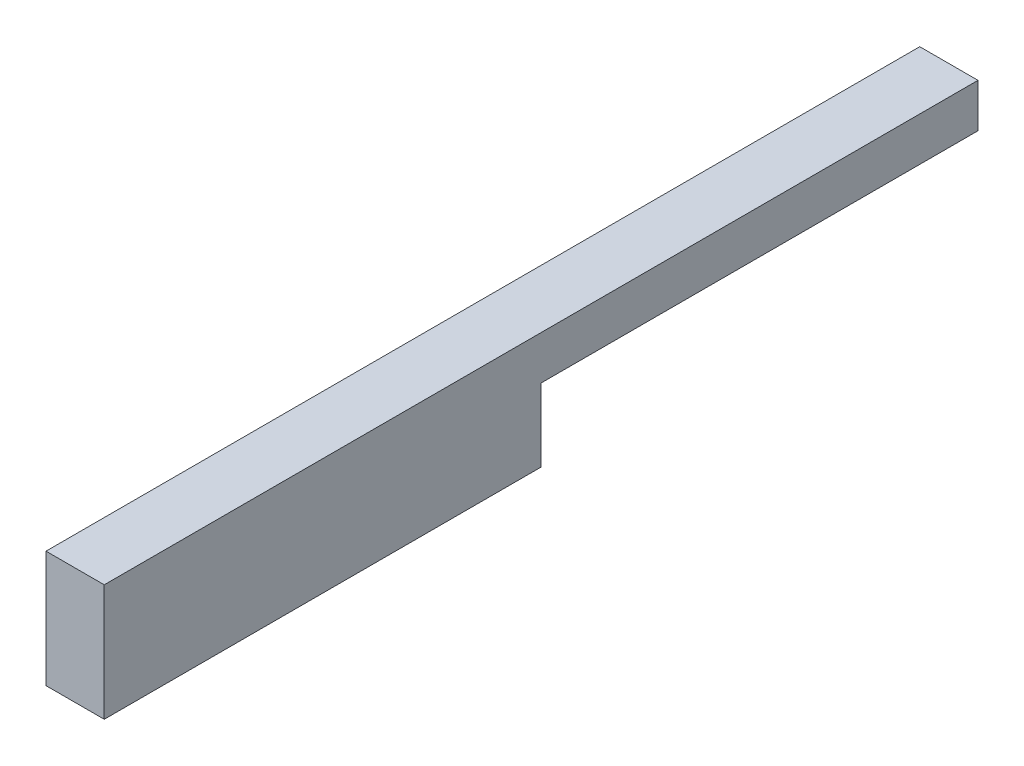
ISO-10303-21;
HEADER;
FILE_DESCRIPTION(('STEP AP214'),'2;1');
FILE_NAME('part.step','',(''),(''),'','','');
FILE_SCHEMA(('AUTOMOTIVE_DESIGN { 1 0 10303 214 1 1 1 1 }'));
ENDSEC;
DATA;
#1=APPLICATION_CONTEXT('core data for automotive mechanical design processes');
#2=APPLICATION_PROTOCOL_DEFINITION('international standard','automotive_design',2000,#1);
#3=PRODUCT_CONTEXT('',#1,'mechanical');
#4=PRODUCT('Part','Part','',(#3));
#5=PRODUCT_RELATED_PRODUCT_CATEGORY('part','',(#4));
#6=PRODUCT_DEFINITION_FORMATION('','',#4);
#7=PRODUCT_DEFINITION_CONTEXT('part definition',#1,'design');
#8=PRODUCT_DEFINITION('design','',#6,#7);
#9=PRODUCT_DEFINITION_SHAPE('','',#8);
#10=(LENGTH_UNIT() NAMED_UNIT(*) SI_UNIT(.MILLI.,.METRE.));
#11=(NAMED_UNIT(*) PLANE_ANGLE_UNIT() SI_UNIT($,.RADIAN.));
#12=(NAMED_UNIT(*) SI_UNIT($,.STERADIAN.) SOLID_ANGLE_UNIT());
#13=UNCERTAINTY_MEASURE_WITH_UNIT(LENGTH_MEASURE(1.E-05),#10,'distance_accuracy_value','');
#14=(GEOMETRIC_REPRESENTATION_CONTEXT(3) GLOBAL_UNCERTAINTY_ASSIGNED_CONTEXT((#13)) GLOBAL_UNIT_ASSIGNED_CONTEXT((#10,
#11,#12)) REPRESENTATION_CONTEXT('',''));
#15=CARTESIAN_POINT('',(0.,0.,0.));
#16=DIRECTION('',(0.,0.,1.));
#17=DIRECTION('',(1.,0.,0.));
#18=AXIS2_PLACEMENT_3D('',#15,#16,#17);
#19=CARTESIAN_POINT('',(4.,0.999349283355752,-40.013014332885));
#20=DIRECTION('',(0.,-1.,0.));
#21=DIRECTION('',(0.,0.,-1.));
#22=AXIS2_PLACEMENT_3D('',#19,#20,#21);
#23=PLANE('',#22);
#24=DIRECTION('',(0.,0.,1.));
#25=VECTOR('',#24,1.);
#26=CARTESIAN_POINT('',(0.,0.999349283355752,-40.013014332885));
#27=LINE('',#26,#25);
#28=CARTESIAN_POINT('',(0.,0.999349283355752,-40.013014332885));
#29=VERTEX_POINT('',#28);
#30=CARTESIAN_POINT('',(0.,0.999349283355745,19.986985667115));
#31=VERTEX_POINT('',#30);
#32=EDGE_CURVE('E128',#29,#31,#27,.T.);
#33=ORIENTED_EDGE('',*,*,#32,.T.);
#34=DIRECTION('',(-1.,0.,0.));
#35=VECTOR('',#34,1.);
#36=CARTESIAN_POINT('',(4.,0.999349283355745,19.986985667115));
#37=LINE('',#36,#35);
#38=CARTESIAN_POINT('',(4.,0.999349283355745,19.986985667115));
#39=VERTEX_POINT('',#38);
#40=EDGE_CURVE('E11',#39,#31,#37,.T.);
#41=ORIENTED_EDGE('',*,*,#40,.F.);
#42=DIRECTION('',(0.,0.,1.));
#43=VECTOR('',#42,1.);
#44=CARTESIAN_POINT('',(4.,0.999349283355752,-40.013014332885));
#45=LINE('',#44,#43);
#46=CARTESIAN_POINT('',(4.,0.999349283355752,-40.013014332885));
#47=VERTEX_POINT('',#46);
#48=EDGE_CURVE('E144',#47,#39,#45,.T.);
#49=ORIENTED_EDGE('',*,*,#48,.F.);
#50=DIRECTION('',(-1.,0.,0.));
#51=VECTOR('',#50,1.);
#52=CARTESIAN_POINT('',(4.,0.999349283355752,-40.013014332885));
#53=LINE('',#52,#51);
#54=EDGE_CURVE('E124',#47,#29,#53,.T.);
#55=ORIENTED_EDGE('',*,*,#54,.T.);
#56=EDGE_LOOP('',(#33,#41,#49,#55));
#57=FACE_BOUND('',#56,.T.);
#58=ADVANCED_FACE('F39',(#57),#23,.F.);
#59=CARTESIAN_POINT('',(4.,-0.383828286737714,19.986985667115));
#60=DIRECTION('',(0.,0.,-1.));
#61=DIRECTION('',(-1.,0.,0.));
#62=AXIS2_PLACEMENT_3D('',#59,#60,#61);
#63=PLANE('',#62);
#64=DIRECTION('',(0.,-1.,0.));
#65=VECTOR('',#64,1.);
#66=CARTESIAN_POINT('',(0.,-0.383828286737714,19.986985667115));
#67=LINE('',#66,#65);
#68=CARTESIAN_POINT('',(0.,-7.00065071664426,19.986985667115));
#69=VERTEX_POINT('',#68);
#70=EDGE_CURVE('E132',#31,#69,#67,.T.);
#71=ORIENTED_EDGE('',*,*,#70,.T.);
#72=DIRECTION('',(-1.,0.,0.));
#73=VECTOR('',#72,1.);
#74=CARTESIAN_POINT('',(4.,-7.00065071664426,19.986985667115));
#75=LINE('',#74,#73);
#76=CARTESIAN_POINT('',(4.,-7.00065071664426,19.986985667115));
#77=VERTEX_POINT('',#76);
#78=EDGE_CURVE('E48',#77,#69,#75,.T.);
#79=ORIENTED_EDGE('',*,*,#78,.F.);
#80=DIRECTION('',(0.,-1.,0.));
#81=VECTOR('',#80,1.);
#82=CARTESIAN_POINT('',(4.,0.999349283355745,19.986985667115));
#83=LINE('',#82,#81);
#84=EDGE_CURVE('E93',#39,#77,#83,.T.);
#85=ORIENTED_EDGE('',*,*,#84,.F.);
#86=ORIENTED_EDGE('',*,*,#40,.T.);
#87=EDGE_LOOP('',(#71,#79,#85,#86));
#88=FACE_BOUND('',#87,.T.);
#89=ADVANCED_FACE('F172',(#88),#63,.F.);
#90=CARTESIAN_POINT('',(4.,-7.00065071664426,19.986985667115));
#91=DIRECTION('',(0.,1.,0.));
#92=DIRECTION('',(0.,0.,1.));
#93=AXIS2_PLACEMENT_3D('',#90,#91,#92);
#94=PLANE('',#93);
#95=DIRECTION('',(0.,0.,-1.));
#96=VECTOR('',#95,1.);
#97=CARTESIAN_POINT('',(0.,-7.00065071664426,19.986985667115));
#98=LINE('',#97,#96);
#99=CARTESIAN_POINT('',(0.,-7.00065071664426,-10.013014332885));
#100=VERTEX_POINT('',#99);
#101=EDGE_CURVE('E135',#69,#100,#98,.T.);
#102=ORIENTED_EDGE('',*,*,#101,.T.);
#103=DIRECTION('',(-1.,0.,0.));
#104=VECTOR('',#103,1.);
#105=CARTESIAN_POINT('',(4.,-7.00065071664426,-10.013014332885));
#106=LINE('',#105,#104);
#107=CARTESIAN_POINT('',(4.,-7.00065071664426,-10.013014332885));
#108=VERTEX_POINT('',#107);
#109=EDGE_CURVE('E117',#108,#100,#106,.T.);
#110=ORIENTED_EDGE('',*,*,#109,.F.);
#111=DIRECTION('',(0.,0.,-1.));
#112=VECTOR('',#111,1.);
#113=CARTESIAN_POINT('',(4.,-7.00065071664426,19.986985667115));
#114=LINE('',#113,#112);
#115=EDGE_CURVE('E106',#77,#108,#114,.T.);
#116=ORIENTED_EDGE('',*,*,#115,.F.);
#117=ORIENTED_EDGE('',*,*,#78,.T.);
#118=EDGE_LOOP('',(#102,#110,#116,#117));
#119=FACE_BOUND('',#118,.T.);
#120=ADVANCED_FACE('F154',(#119),#94,.F.);
#121=CARTESIAN_POINT('',(4.,-7.00065071664426,-10.013014332885));
#122=DIRECTION('',(0.,0.,1.));
#123=DIRECTION('',(0.,-1.,0.));
#124=AXIS2_PLACEMENT_3D('',#121,#122,#123);
#125=PLANE('',#124);
#126=DIRECTION('',(0.,1.,0.));
#127=VECTOR('',#126,1.);
#128=CARTESIAN_POINT('',(0.,-7.00065071664426,-10.013014332885));
#129=LINE('',#128,#127);
#130=CARTESIAN_POINT('',(0.,-2.00065071664425,-10.013014332885));
#131=VERTEX_POINT('',#130);
#132=EDGE_CURVE('E115',#100,#131,#129,.T.);
#133=ORIENTED_EDGE('',*,*,#132,.T.);
#134=DIRECTION('',(-1.,0.,0.));
#135=VECTOR('',#134,1.);
#136=CARTESIAN_POINT('',(4.,-2.00065071664425,-10.013014332885));
#137=LINE('',#136,#135);
#138=CARTESIAN_POINT('',(4.,-2.00065071664425,-10.013014332885));
#139=VERTEX_POINT('',#138);
#140=EDGE_CURVE('E112',#139,#131,#137,.T.);
#141=ORIENTED_EDGE('',*,*,#140,.F.);
#142=DIRECTION('',(0.,1.,0.));
#143=VECTOR('',#142,1.);
#144=CARTESIAN_POINT('',(4.,-7.00065071664426,-10.013014332885));
#145=LINE('',#144,#143);
#146=EDGE_CURVE('E100',#108,#139,#145,.T.);
#147=ORIENTED_EDGE('',*,*,#146,.F.);
#148=ORIENTED_EDGE('',*,*,#109,.T.);
#149=EDGE_LOOP('',(#133,#141,#147,#148));
#150=FACE_BOUND('',#149,.T.);
#151=ADVANCED_FACE('F113',(#150),#125,.F.);
#152=CARTESIAN_POINT('',(4.,-2.00065071664425,-40.013014332885));
#153=DIRECTION('',(0.,1.,0.));
#154=DIRECTION('',(0.,0.,1.));
#155=AXIS2_PLACEMENT_3D('',#152,#153,#154);
#156=PLANE('',#155);
#157=DIRECTION('',(0.,0.,-1.));
#158=VECTOR('',#157,1.);
#159=CARTESIAN_POINT('',(0.,-2.00065071664425,-40.013014332885));
#160=LINE('',#159,#158);
#161=CARTESIAN_POINT('',(0.,-2.00065071664425,-40.013014332885));
#162=VERTEX_POINT('',#161);
#163=EDGE_CURVE('E79',#131,#162,#160,.T.);
#164=ORIENTED_EDGE('',*,*,#163,.T.);
#165=DIRECTION('',(-1.,0.,0.));
#166=VECTOR('',#165,1.);
#167=CARTESIAN_POINT('',(4.,-2.00065071664425,-40.013014332885));
#168=LINE('',#167,#166);
#169=CARTESIAN_POINT('',(4.,-2.00065071664425,-40.013014332885));
#170=VERTEX_POINT('',#169);
#171=EDGE_CURVE('E118',#170,#162,#168,.T.);
#172=ORIENTED_EDGE('',*,*,#171,.F.);
#173=DIRECTION('',(0.,0.,-1.));
#174=VECTOR('',#173,1.);
#175=CARTESIAN_POINT('',(4.,-2.00065071664425,-40.013014332885));
#176=LINE('',#175,#174);
#177=EDGE_CURVE('E104',#139,#170,#176,.T.);
#178=ORIENTED_EDGE('',*,*,#177,.F.);
#179=ORIENTED_EDGE('',*,*,#140,.T.);
#180=EDGE_LOOP('',(#164,#172,#178,#179));
#181=FACE_BOUND('',#180,.T.);
#182=ADVANCED_FACE('F120',(#181),#156,.F.);
#183=CARTESIAN_POINT('',(4.,-2.00065071664425,-40.013014332885));
#184=DIRECTION('',(0.,0.,1.));
#185=DIRECTION('',(1.,0.,0.));
#186=AXIS2_PLACEMENT_3D('',#183,#184,#185);
#187=PLANE('',#186);
#188=DIRECTION('',(0.,1.,0.));
#189=VECTOR('',#188,1.);
#190=CARTESIAN_POINT('',(0.,-2.00065071664425,-40.013014332885));
#191=LINE('',#190,#189);
#192=EDGE_CURVE('E85',#162,#29,#191,.T.);
#193=ORIENTED_EDGE('',*,*,#192,.T.);
#194=ORIENTED_EDGE('',*,*,#54,.F.);
#195=DIRECTION('',(0.,1.,0.));
#196=VECTOR('',#195,1.);
#197=CARTESIAN_POINT('',(4.,-2.00065071664425,-40.013014332885));
#198=LINE('',#197,#196);
#199=EDGE_CURVE('E56',#170,#47,#198,.T.);
#200=ORIENTED_EDGE('',*,*,#199,.F.);
#201=ORIENTED_EDGE('',*,*,#171,.T.);
#202=EDGE_LOOP('',(#193,#194,#200,#201));
#203=FACE_BOUND('',#202,.T.);
#204=ADVANCED_FACE('F161',(#203),#187,.F.);
#205=CARTESIAN_POINT('',(4.,0.,0.));
#206=DIRECTION('',(1.,0.,0.));
#207=DIRECTION('',(0.,0.,-1.));
#208=AXIS2_PLACEMENT_3D('',#205,#206,#207);
#209=PLANE('',#208);
#210=ORIENTED_EDGE('',*,*,#48,.T.);
#211=ORIENTED_EDGE('',*,*,#84,.T.);
#212=ORIENTED_EDGE('',*,*,#115,.T.);
#213=ORIENTED_EDGE('',*,*,#146,.T.);
#214=ORIENTED_EDGE('',*,*,#177,.T.);
#215=ORIENTED_EDGE('',*,*,#199,.T.);
#216=EDGE_LOOP('',(#210,#211,#212,#213,#214,#215));
#217=FACE_BOUND('',#216,.T.);
#218=ADVANCED_FACE('F102',(#217),#209,.T.);
#219=CARTESIAN_POINT('',(0.,0.,0.));
#220=DIRECTION('',(1.,0.,0.));
#221=DIRECTION('',(0.,0.,-1.));
#222=AXIS2_PLACEMENT_3D('',#219,#220,#221);
#223=PLANE('',#222);
#224=ORIENTED_EDGE('',*,*,#32,.F.);
#225=ORIENTED_EDGE('',*,*,#192,.F.);
#226=ORIENTED_EDGE('',*,*,#163,.F.);
#227=ORIENTED_EDGE('',*,*,#132,.F.);
#228=ORIENTED_EDGE('',*,*,#101,.F.);
#229=ORIENTED_EDGE('',*,*,#70,.F.);
#230=EDGE_LOOP('',(#224,#225,#226,#227,#228,#229));
#231=FACE_BOUND('',#230,.T.);
#232=ADVANCED_FACE('F157',(#231),#223,.F.);
#233=CLOSED_SHELL('',(#58,#89,#120,#151,#182,#204,#218,#232));
#234=MANIFOLD_SOLID_BREP('B2',#233);
#235=ADVANCED_BREP_SHAPE_REPRESENTATION('',(#18,#234),#14);
#236=SHAPE_DEFINITION_REPRESENTATION(#9,#235);
ENDSEC;
END-ISO-10303-21;
